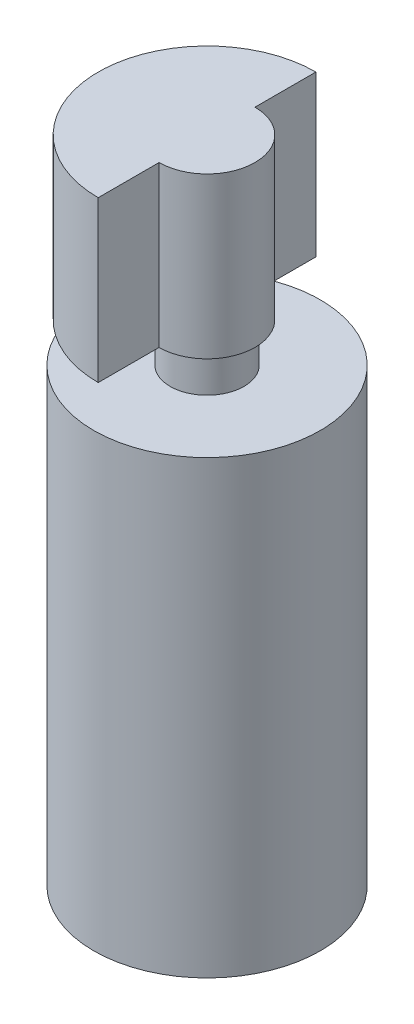
ISO-10303-21;
HEADER;
FILE_DESCRIPTION(('STEP AP214'),'2;1');
FILE_NAME('part.step','',(''),(''),'','','');
FILE_SCHEMA(('AUTOMOTIVE_DESIGN { 1 0 10303 214 1 1 1 1 }'));
ENDSEC;
DATA;
#1=APPLICATION_CONTEXT('core data for automotive mechanical design processes');
#2=APPLICATION_PROTOCOL_DEFINITION('international standard','automotive_design',2000,#1);
#3=PRODUCT_CONTEXT('',#1,'mechanical');
#4=PRODUCT('Part','Part','',(#3));
#5=PRODUCT_RELATED_PRODUCT_CATEGORY('part','',(#4));
#6=PRODUCT_DEFINITION_FORMATION('','',#4);
#7=PRODUCT_DEFINITION_CONTEXT('part definition',#1,'design');
#8=PRODUCT_DEFINITION('design','',#6,#7);
#9=PRODUCT_DEFINITION_SHAPE('','',#8);
#10=(LENGTH_UNIT() NAMED_UNIT(*) SI_UNIT(.MILLI.,.METRE.));
#11=(NAMED_UNIT(*) PLANE_ANGLE_UNIT() SI_UNIT($,.RADIAN.));
#12=(NAMED_UNIT(*) SI_UNIT($,.STERADIAN.) SOLID_ANGLE_UNIT());
#13=UNCERTAINTY_MEASURE_WITH_UNIT(LENGTH_MEASURE(1.E-05),#10,'distance_accuracy_value','');
#14=(GEOMETRIC_REPRESENTATION_CONTEXT(3) GLOBAL_UNCERTAINTY_ASSIGNED_CONTEXT((#13)) GLOBAL_UNIT_ASSIGNED_CONTEXT((#10,
#11,#12)) REPRESENTATION_CONTEXT('',''));
#15=CARTESIAN_POINT('',(0.,0.,0.));
#16=DIRECTION('',(0.,0.,1.));
#17=DIRECTION('',(1.,0.,0.));
#18=AXIS2_PLACEMENT_3D('',#15,#16,#17);
#19=CARTESIAN_POINT('',(0.,11.938,0.));
#20=DIRECTION('',(0.,-1.,0.));
#21=DIRECTION('',(0.,0.,-1.));
#22=AXIS2_PLACEMENT_3D('',#19,#20,#21);
#23=CYLINDRICAL_SURFACE('',#22,3.);
#24=CARTESIAN_POINT('',(0.,11.938,0.));
#25=DIRECTION('',(0.,1.,0.));
#26=DIRECTION('',(0.,0.,1.));
#27=AXIS2_PLACEMENT_3D('',#24,#25,#26);
#28=CIRCLE('',#27,3.);
#29=CARTESIAN_POINT('',(0.,11.938,3.));
#30=VERTEX_POINT('',#29);
#31=EDGE_CURVE('E13',#30,#30,#28,.T.);
#32=ORIENTED_EDGE('',*,*,#31,.F.);
#33=EDGE_LOOP('',(#32));
#34=FACE_BOUND('',#33,.T.);
#35=CARTESIAN_POINT('',(0.,0.,0.));
#36=DIRECTION('',(0.,1.,0.));
#37=DIRECTION('',(0.,0.,1.));
#38=AXIS2_PLACEMENT_3D('',#35,#36,#37);
#39=CIRCLE('',#38,3.);
#40=CARTESIAN_POINT('',(0.,0.,3.));
#41=VERTEX_POINT('',#40);
#42=EDGE_CURVE('E53',#41,#41,#39,.T.);
#43=ORIENTED_EDGE('',*,*,#42,.T.);
#44=EDGE_LOOP('',(#43));
#45=FACE_BOUND('',#44,.T.);
#46=ADVANCED_FACE('F44',(#34,#45),#23,.T.);
#47=CARTESIAN_POINT('',(0.,11.938,0.));
#48=DIRECTION('',(0.,1.,0.));
#49=DIRECTION('',(0.,0.,1.));
#50=AXIS2_PLACEMENT_3D('',#47,#48,#49);
#51=PLANE('',#50);
#52=CARTESIAN_POINT('',(0.,11.938,0.));
#53=DIRECTION('',(0.,1.,0.));
#54=DIRECTION('',(0.,0.,1.));
#55=AXIS2_PLACEMENT_3D('',#52,#53,#54);
#56=CIRCLE('',#55,0.9779);
#57=CARTESIAN_POINT('',(0.,11.938,0.9779));
#58=VERTEX_POINT('',#57);
#59=EDGE_CURVE('E122',#58,#58,#56,.T.);
#60=ORIENTED_EDGE('',*,*,#59,.F.);
#61=EDGE_LOOP('',(#60));
#62=FACE_BOUND('',#61,.T.);
#63=ORIENTED_EDGE('',*,*,#31,.T.);
#64=EDGE_LOOP('',(#63));
#65=FACE_BOUND('',#64,.T.);
#66=ADVANCED_FACE('F131',(#62,#65),#51,.T.);
#67=CARTESIAN_POINT('',(0.,0.,0.));
#68=DIRECTION('',(0.,1.,0.));
#69=DIRECTION('',(0.,0.,1.));
#70=AXIS2_PLACEMENT_3D('',#67,#68,#69);
#71=PLANE('',#70);
#72=ORIENTED_EDGE('',*,*,#42,.F.);
#73=EDGE_LOOP('',(#72));
#74=FACE_BOUND('',#73,.T.);
#75=ADVANCED_FACE('F128',(#74),#71,.F.);
#76=CARTESIAN_POINT('',(0.,17.2212,0.));
#77=DIRECTION('',(0.,-1.,0.));
#78=DIRECTION('',(0.,0.,-1.));
#79=AXIS2_PLACEMENT_3D('',#76,#77,#78);
#80=CYLINDRICAL_SURFACE('',#79,0.9779);
#81=CARTESIAN_POINT('',(0.,12.9794,0.));
#82=DIRECTION('',(0.,-1.,0.));
#83=DIRECTION('',(0.,0.,-1.));
#84=AXIS2_PLACEMENT_3D('',#81,#82,#83);
#85=CIRCLE('',#84,0.9779);
#86=CARTESIAN_POINT('',(0.,12.9794,-0.9779));
#87=VERTEX_POINT('',#86);
#88=EDGE_CURVE('E47',#87,#87,#85,.T.);
#89=ORIENTED_EDGE('',*,*,#88,.T.);
#90=EDGE_LOOP('',(#89));
#91=FACE_BOUND('',#90,.T.);
#92=ORIENTED_EDGE('',*,*,#59,.T.);
#93=EDGE_LOOP('',(#92));
#94=FACE_BOUND('',#93,.T.);
#95=ADVANCED_FACE('F130',(#91,#94),#80,.T.);
#96=CARTESIAN_POINT('',(0.,12.9794,0.));
#97=DIRECTION('',(0.,1.,0.));
#98=DIRECTION('',(0.,0.,1.));
#99=AXIS2_PLACEMENT_3D('',#96,#97,#98);
#100=CYLINDRICAL_SURFACE('',#99,2.8829);
#101=CARTESIAN_POINT('',(0.,17.2212,0.));
#102=DIRECTION('',(0.,-1.,0.));
#103=DIRECTION('',(0.,0.,-1.));
#104=AXIS2_PLACEMENT_3D('',#101,#102,#103);
#105=CIRCLE('',#104,2.8829);
#106=CARTESIAN_POINT('',(0.,17.2212,2.8829));
#107=VERTEX_POINT('',#106);
#108=CARTESIAN_POINT('',(0.,17.2212,-2.8829));
#109=VERTEX_POINT('',#108);
#110=EDGE_CURVE('E113',#107,#109,#105,.T.);
#111=ORIENTED_EDGE('',*,*,#110,.T.);
#112=DIRECTION('',(0.,1.,0.));
#113=VECTOR('',#112,1.);
#114=CARTESIAN_POINT('',(0.,12.9794,-2.8829));
#115=LINE('',#114,#113);
#116=CARTESIAN_POINT('',(0.,12.9794,-2.8829));
#117=VERTEX_POINT('',#116);
#118=EDGE_CURVE('E104',#117,#109,#115,.T.);
#119=ORIENTED_EDGE('',*,*,#118,.F.);
#120=CARTESIAN_POINT('',(0.,12.9794,0.));
#121=DIRECTION('',(0.,-1.,0.));
#122=DIRECTION('',(0.,0.,-1.));
#123=AXIS2_PLACEMENT_3D('',#120,#121,#122);
#124=CIRCLE('',#123,2.8829);
#125=CARTESIAN_POINT('',(0.,12.9794,2.8829));
#126=VERTEX_POINT('',#125);
#127=EDGE_CURVE('E98',#126,#117,#124,.T.);
#128=ORIENTED_EDGE('',*,*,#127,.F.);
#129=DIRECTION('',(0.,1.,0.));
#130=VECTOR('',#129,1.);
#131=CARTESIAN_POINT('',(0.,12.9794,2.8829));
#132=LINE('',#131,#130);
#133=EDGE_CURVE('E109',#126,#107,#132,.T.);
#134=ORIENTED_EDGE('',*,*,#133,.T.);
#135=EDGE_LOOP('',(#111,#119,#128,#134));
#136=FACE_BOUND('',#135,.T.);
#137=ADVANCED_FACE('F136',(#136),#100,.T.);
#138=CARTESIAN_POINT('',(0.,12.9794,-1.27));
#139=DIRECTION('',(-1.,0.,0.));
#140=DIRECTION('',(0.,0.,1.));
#141=AXIS2_PLACEMENT_3D('',#138,#139,#140);
#142=PLANE('',#141);
#143=DIRECTION('',(0.,0.,1.));
#144=VECTOR('',#143,1.);
#145=CARTESIAN_POINT('',(0.,17.2212,-1.27));
#146=LINE('',#145,#144);
#147=CARTESIAN_POINT('',(0.,17.2212,-1.27));
#148=VERTEX_POINT('',#147);
#149=EDGE_CURVE('E103',#109,#148,#146,.T.);
#150=ORIENTED_EDGE('',*,*,#149,.T.);
#151=DIRECTION('',(0.,1.,0.));
#152=VECTOR('',#151,1.);
#153=CARTESIAN_POINT('',(0.,12.9794,-1.27));
#154=LINE('',#153,#152);
#155=CARTESIAN_POINT('',(0.,12.9794,-1.27));
#156=VERTEX_POINT('',#155);
#157=EDGE_CURVE('E101',#156,#148,#154,.T.);
#158=ORIENTED_EDGE('',*,*,#157,.F.);
#159=DIRECTION('',(0.,0.,1.));
#160=VECTOR('',#159,1.);
#161=CARTESIAN_POINT('',(0.,12.9794,-1.27));
#162=LINE('',#161,#160);
#163=EDGE_CURVE('E93',#117,#156,#162,.T.);
#164=ORIENTED_EDGE('',*,*,#163,.F.);
#165=ORIENTED_EDGE('',*,*,#118,.T.);
#166=EDGE_LOOP('',(#150,#158,#164,#165));
#167=FACE_BOUND('',#166,.T.);
#168=ADVANCED_FACE('F102',(#167),#142,.F.);
#169=CARTESIAN_POINT('',(0.,12.9794,0.));
#170=DIRECTION('',(0.,1.,0.));
#171=DIRECTION('',(0.,0.,1.));
#172=AXIS2_PLACEMENT_3D('',#169,#170,#171);
#173=CYLINDRICAL_SURFACE('',#172,1.27);
#174=CARTESIAN_POINT('',(0.,17.2212,0.));
#175=DIRECTION('',(0.,-1.,0.));
#176=DIRECTION('',(0.,0.,-1.));
#177=AXIS2_PLACEMENT_3D('',#174,#175,#176);
#178=CIRCLE('',#177,1.27);
#179=CARTESIAN_POINT('',(0.,17.2212,1.27));
#180=VERTEX_POINT('',#179);
#181=EDGE_CURVE('E79',#148,#180,#178,.T.);
#182=ORIENTED_EDGE('',*,*,#181,.T.);
#183=DIRECTION('',(0.,1.,0.));
#184=VECTOR('',#183,1.);
#185=CARTESIAN_POINT('',(0.,12.9794,1.27));
#186=LINE('',#185,#184);
#187=CARTESIAN_POINT('',(0.,12.9794,1.27));
#188=VERTEX_POINT('',#187);
#189=EDGE_CURVE('E105',#188,#180,#186,.T.);
#190=ORIENTED_EDGE('',*,*,#189,.F.);
#191=CARTESIAN_POINT('',(0.,12.9794,0.));
#192=DIRECTION('',(0.,-1.,0.));
#193=DIRECTION('',(0.,0.,-1.));
#194=AXIS2_PLACEMENT_3D('',#191,#192,#193);
#195=CIRCLE('',#194,1.27);
#196=EDGE_CURVE('E96',#156,#188,#195,.T.);
#197=ORIENTED_EDGE('',*,*,#196,.F.);
#198=ORIENTED_EDGE('',*,*,#157,.T.);
#199=EDGE_LOOP('',(#182,#190,#197,#198));
#200=FACE_BOUND('',#199,.T.);
#201=ADVANCED_FACE('F107',(#200),#173,.T.);
#202=CARTESIAN_POINT('',(0.,12.9794,2.8829));
#203=DIRECTION('',(-1.,0.,0.));
#204=DIRECTION('',(0.,0.,1.));
#205=AXIS2_PLACEMENT_3D('',#202,#203,#204);
#206=PLANE('',#205);
#207=DIRECTION('',(0.,0.,1.));
#208=VECTOR('',#207,1.);
#209=CARTESIAN_POINT('',(0.,17.2212,2.8829));
#210=LINE('',#209,#208);
#211=EDGE_CURVE('E85',#180,#107,#210,.T.);
#212=ORIENTED_EDGE('',*,*,#211,.T.);
#213=ORIENTED_EDGE('',*,*,#133,.F.);
#214=DIRECTION('',(0.,0.,1.));
#215=VECTOR('',#214,1.);
#216=CARTESIAN_POINT('',(0.,12.9794,2.8829));
#217=LINE('',#216,#215);
#218=EDGE_CURVE('E62',#188,#126,#217,.T.);
#219=ORIENTED_EDGE('',*,*,#218,.F.);
#220=ORIENTED_EDGE('',*,*,#189,.T.);
#221=EDGE_LOOP('',(#212,#213,#219,#220));
#222=FACE_BOUND('',#221,.T.);
#223=ADVANCED_FACE('F186',(#222),#206,.F.);
#224=CARTESIAN_POINT('',(0.,12.9794,0.));
#225=DIRECTION('',(0.,-1.,0.));
#226=DIRECTION('',(0.,0.,-1.));
#227=AXIS2_PLACEMENT_3D('',#224,#225,#226);
#228=PLANE('',#227);
#229=ORIENTED_EDGE('',*,*,#88,.F.);
#230=EDGE_LOOP('',(#229));
#231=FACE_BOUND('',#230,.T.);
#232=ORIENTED_EDGE('',*,*,#127,.T.);
#233=ORIENTED_EDGE('',*,*,#163,.T.);
#234=ORIENTED_EDGE('',*,*,#196,.T.);
#235=ORIENTED_EDGE('',*,*,#218,.T.);
#236=EDGE_LOOP('',(#232,#233,#234,#235));
#237=FACE_BOUND('',#236,.T.);
#238=ADVANCED_FACE('F94',(#231,#237),#228,.T.);
#239=CARTESIAN_POINT('',(0.,17.2212,0.));
#240=DIRECTION('',(0.,1.,0.));
#241=DIRECTION('',(0.,0.,1.));
#242=AXIS2_PLACEMENT_3D('',#239,#240,#241);
#243=PLANE('',#242);
#244=ORIENTED_EDGE('',*,*,#110,.F.);
#245=ORIENTED_EDGE('',*,*,#211,.F.);
#246=ORIENTED_EDGE('',*,*,#181,.F.);
#247=ORIENTED_EDGE('',*,*,#149,.F.);
#248=EDGE_LOOP('',(#244,#245,#246,#247));
#249=FACE_BOUND('',#248,.T.);
#250=ADVANCED_FACE('F203',(#249),#243,.T.);
#251=CLOSED_SHELL('',(#46,#66,#75,#95,#137,#168,#201,#223,#238,#250));
#252=MANIFOLD_SOLID_BREP('B2',#251);
#253=ADVANCED_BREP_SHAPE_REPRESENTATION('',(#18,#252),#14);
#254=SHAPE_DEFINITION_REPRESENTATION(#9,#253);
ENDSEC;
END-ISO-10303-21;
